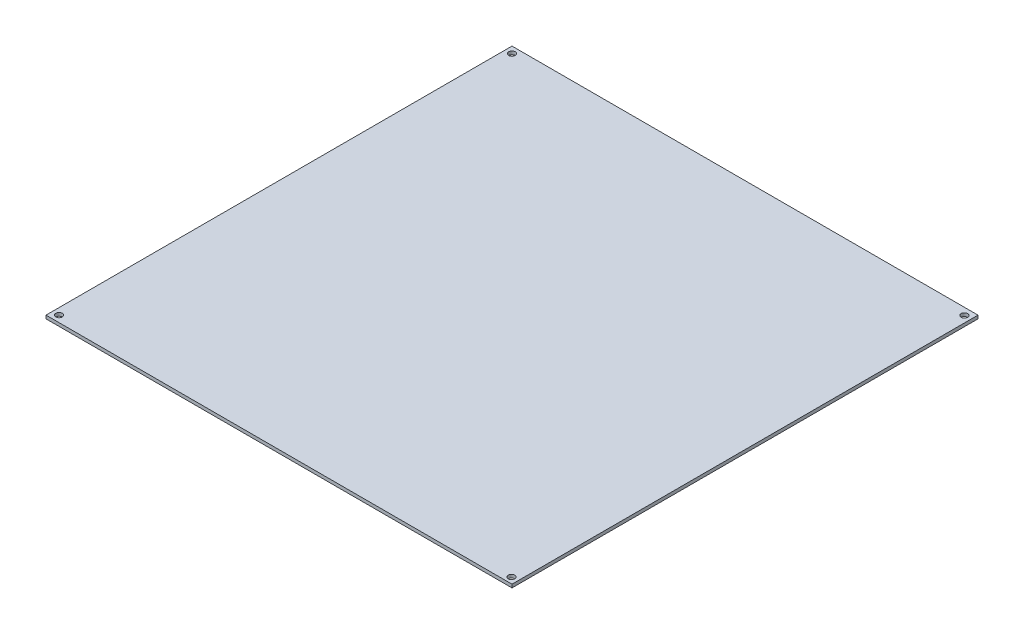
ISO-10303-21;
HEADER;
FILE_DESCRIPTION(('STEP AP214'),'2;1');
FILE_NAME('part.step','',(''),(''),'','','');
FILE_SCHEMA(('AUTOMOTIVE_DESIGN { 1 0 10303 214 1 1 1 1 }'));
ENDSEC;
DATA;
#1=APPLICATION_CONTEXT('core data for automotive mechanical design processes');
#2=APPLICATION_PROTOCOL_DEFINITION('international standard','automotive_design',2000,#1);
#3=PRODUCT_CONTEXT('',#1,'mechanical');
#4=PRODUCT('Part','Part','',(#3));
#5=PRODUCT_RELATED_PRODUCT_CATEGORY('part','',(#4));
#6=PRODUCT_DEFINITION_FORMATION('','',#4);
#7=PRODUCT_DEFINITION_CONTEXT('part definition',#1,'design');
#8=PRODUCT_DEFINITION('design','',#6,#7);
#9=PRODUCT_DEFINITION_SHAPE('','',#8);
#10=(LENGTH_UNIT() NAMED_UNIT(*) SI_UNIT(.MILLI.,.METRE.));
#11=(NAMED_UNIT(*) PLANE_ANGLE_UNIT() SI_UNIT($,.RADIAN.));
#12=(NAMED_UNIT(*) SI_UNIT($,.STERADIAN.) SOLID_ANGLE_UNIT());
#13=UNCERTAINTY_MEASURE_WITH_UNIT(LENGTH_MEASURE(1.E-05),#10,'distance_accuracy_value','');
#14=(GEOMETRIC_REPRESENTATION_CONTEXT(3) GLOBAL_UNCERTAINTY_ASSIGNED_CONTEXT((#13)) GLOBAL_UNIT_ASSIGNED_CONTEXT((#10,
#11,#12)) REPRESENTATION_CONTEXT('',''));
#15=CARTESIAN_POINT('',(0.,0.,0.));
#16=DIRECTION('',(0.,0.,1.));
#17=DIRECTION('',(1.,0.,0.));
#18=AXIS2_PLACEMENT_3D('',#15,#16,#17);
#19=CARTESIAN_POINT('',(0.,1.5,0.));
#20=DIRECTION('',(0.,1.,0.));
#21=DIRECTION('',(0.,0.,1.));
#22=AXIS2_PLACEMENT_3D('',#19,#20,#21);
#23=PLANE('',#22);
#24=CARTESIAN_POINT('',(-122.042987014463,1.5,149.317647058824));
#25=DIRECTION('',(0.,1.,0.));
#26=DIRECTION('',(0.,0.,1.));
#27=AXIS2_PLACEMENT_3D('',#24,#25,#26);
#28=CIRCLE('',#27,1.5);
#29=CARTESIAN_POINT('',(-122.042987014463,1.5,150.817647058824));
#30=VERTEX_POINT('',#29);
#31=EDGE_CURVE('E126',#30,#30,#28,.T.);
#32=ORIENTED_EDGE('',*,*,#31,.F.);
#33=EDGE_LOOP('',(#32));
#34=FACE_BOUND('',#33,.T.);
#35=CARTESIAN_POINT('',(-122.042987014463,1.5,-58.6823529411764));
#36=DIRECTION('',(0.,1.,0.));
#37=DIRECTION('',(0.,0.,1.));
#38=AXIS2_PLACEMENT_3D('',#35,#36,#37);
#39=CIRCLE('',#38,1.5);
#40=CARTESIAN_POINT('',(-122.042987014463,1.5,-57.1823529411764));
#41=VERTEX_POINT('',#40);
#42=EDGE_CURVE('E105',#41,#41,#39,.T.);
#43=ORIENTED_EDGE('',*,*,#42,.F.);
#44=EDGE_LOOP('',(#43));
#45=FACE_BOUND('',#44,.T.);
#46=DIRECTION('',(0.,0.,1.));
#47=VECTOR('',#46,1.);
#48=CARTESIAN_POINT('',(-125.043137254902,1.5,-61.6823529411765));
#49=LINE('',#48,#47);
#50=CARTESIAN_POINT('',(-125.043137254902,1.5,-61.6823529411765));
#51=VERTEX_POINT('',#50);
#52=CARTESIAN_POINT('',(-125.043137254902,1.5,152.317647058824));
#53=VERTEX_POINT('',#52);
#54=EDGE_CURVE('E90',#51,#53,#49,.T.);
#55=ORIENTED_EDGE('',*,*,#54,.T.);
#56=DIRECTION('',(1.,0.,0.));
#57=VECTOR('',#56,1.);
#58=CARTESIAN_POINT('',(-125.043137254902,1.5,152.317647058824));
#59=LINE('',#58,#57);
#60=CARTESIAN_POINT('',(88.9568627450981,1.5,152.317647058824));
#61=VERTEX_POINT('',#60);
#62=EDGE_CURVE('E85',#53,#61,#59,.T.);
#63=ORIENTED_EDGE('',*,*,#62,.T.);
#64=DIRECTION('',(0.,0.,-1.));
#65=VECTOR('',#64,1.);
#66=CARTESIAN_POINT('',(88.9568627450981,1.5,-61.6823529411765));
#67=LINE('',#66,#65);
#68=CARTESIAN_POINT('',(88.9568627450981,1.5,-61.6823529411765));
#69=VERTEX_POINT('',#68);
#70=EDGE_CURVE('E88',#61,#69,#67,.T.);
#71=ORIENTED_EDGE('',*,*,#70,.T.);
#72=DIRECTION('',(-1.,0.,0.));
#73=VECTOR('',#72,1.);
#74=CARTESIAN_POINT('',(-125.043137254902,1.5,-61.6823529411765));
#75=LINE('',#74,#73);
#76=EDGE_CURVE('E55',#69,#51,#75,.T.);
#77=ORIENTED_EDGE('',*,*,#76,.T.);
#78=EDGE_LOOP('',(#55,#63,#71,#77));
#79=FACE_BOUND('',#78,.T.);
#80=CARTESIAN_POINT('',(85.9568627450981,1.5,-58.4323529411764));
#81=DIRECTION('',(0.,1.,0.));
#82=DIRECTION('',(0.,0.,1.));
#83=AXIS2_PLACEMENT_3D('',#80,#81,#82);
#84=CIRCLE('',#83,1.5);
#85=CARTESIAN_POINT('',(85.9568627450981,1.5,-56.9323529411764));
#86=VERTEX_POINT('',#85);
#87=EDGE_CURVE('E120',#86,#86,#84,.T.);
#88=ORIENTED_EDGE('',*,*,#87,.F.);
#89=EDGE_LOOP('',(#88));
#90=FACE_BOUND('',#89,.T.);
#91=CARTESIAN_POINT('',(85.9568627450981,1.5,149.567647058824));
#92=DIRECTION('',(0.,1.,0.));
#93=DIRECTION('',(0.,0.,1.));
#94=AXIS2_PLACEMENT_3D('',#91,#92,#93);
#95=CIRCLE('',#94,1.5);
#96=CARTESIAN_POINT('',(85.9568627450981,1.5,151.067647058824));
#97=VERTEX_POINT('',#96);
#98=EDGE_CURVE('E132',#97,#97,#95,.T.);
#99=ORIENTED_EDGE('',*,*,#98,.F.);
#100=EDGE_LOOP('',(#99));
#101=FACE_BOUND('',#100,.T.);
#102=ADVANCED_FACE('F38',(#34,#45,#79,#90,#101),#23,.T.);
#103=CARTESIAN_POINT('',(0.,0.,0.));
#104=DIRECTION('',(0.,1.,0.));
#105=DIRECTION('',(0.,0.,1.));
#106=AXIS2_PLACEMENT_3D('',#103,#104,#105);
#107=PLANE('',#106);
#108=DIRECTION('',(0.,0.,1.));
#109=VECTOR('',#108,1.);
#110=CARTESIAN_POINT('',(-125.043137254902,0.,-61.6823529411765));
#111=LINE('',#110,#109);
#112=CARTESIAN_POINT('',(-125.043137254902,0.,-61.6823529411765));
#113=VERTEX_POINT('',#112);
#114=CARTESIAN_POINT('',(-125.043137254902,0.,152.317647058824));
#115=VERTEX_POINT('',#114);
#116=EDGE_CURVE('E102',#113,#115,#111,.T.);
#117=ORIENTED_EDGE('',*,*,#116,.F.);
#118=DIRECTION('',(-1.,0.,0.));
#119=VECTOR('',#118,1.);
#120=CARTESIAN_POINT('',(-125.043137254902,0.,-61.6823529411765));
#121=LINE('',#120,#119);
#122=CARTESIAN_POINT('',(88.9568627450981,0.,-61.6823529411765));
#123=VERTEX_POINT('',#122);
#124=EDGE_CURVE('E78',#123,#113,#121,.T.);
#125=ORIENTED_EDGE('',*,*,#124,.F.);
#126=DIRECTION('',(0.,0.,-1.));
#127=VECTOR('',#126,1.);
#128=CARTESIAN_POINT('',(88.9568627450981,0.,-61.6823529411765));
#129=LINE('',#128,#127);
#130=CARTESIAN_POINT('',(88.9568627450981,0.,152.317647058824));
#131=VERTEX_POINT('',#130);
#132=EDGE_CURVE('E72',#131,#123,#129,.T.);
#133=ORIENTED_EDGE('',*,*,#132,.F.);
#134=DIRECTION('',(1.,0.,0.));
#135=VECTOR('',#134,1.);
#136=CARTESIAN_POINT('',(-125.043137254902,0.,152.317647058824));
#137=LINE('',#136,#135);
#138=EDGE_CURVE('E94',#115,#131,#137,.T.);
#139=ORIENTED_EDGE('',*,*,#138,.F.);
#140=EDGE_LOOP('',(#117,#125,#133,#139));
#141=FACE_BOUND('',#140,.T.);
#142=CARTESIAN_POINT('',(-122.042987014463,0.,-58.6823529411764));
#143=DIRECTION('',(0.,1.,0.));
#144=DIRECTION('',(0.,0.,1.));
#145=AXIS2_PLACEMENT_3D('',#142,#143,#144);
#146=CIRCLE('',#145,1.5);
#147=CARTESIAN_POINT('',(-122.042987014463,0.,-57.1823529411764));
#148=VERTEX_POINT('',#147);
#149=EDGE_CURVE('E117',#148,#148,#146,.T.);
#150=ORIENTED_EDGE('',*,*,#149,.T.);
#151=EDGE_LOOP('',(#150));
#152=FACE_BOUND('',#151,.T.);
#153=CARTESIAN_POINT('',(85.9568627450981,0.,-58.4323529411764));
#154=DIRECTION('',(0.,1.,0.));
#155=DIRECTION('',(0.,0.,1.));
#156=AXIS2_PLACEMENT_3D('',#153,#154,#155);
#157=CIRCLE('',#156,1.5);
#158=CARTESIAN_POINT('',(85.9568627450981,0.,-56.9323529411764));
#159=VERTEX_POINT('',#158);
#160=EDGE_CURVE('E123',#159,#159,#157,.T.);
#161=ORIENTED_EDGE('',*,*,#160,.T.);
#162=EDGE_LOOP('',(#161));
#163=FACE_BOUND('',#162,.T.);
#164=CARTESIAN_POINT('',(-122.042987014463,0.,149.317647058824));
#165=DIRECTION('',(0.,1.,0.));
#166=DIRECTION('',(0.,0.,1.));
#167=AXIS2_PLACEMENT_3D('',#164,#165,#166);
#168=CIRCLE('',#167,1.5);
#169=CARTESIAN_POINT('',(-122.042987014463,0.,150.817647058824));
#170=VERTEX_POINT('',#169);
#171=EDGE_CURVE('E129',#170,#170,#168,.T.);
#172=ORIENTED_EDGE('',*,*,#171,.T.);
#173=EDGE_LOOP('',(#172));
#174=FACE_BOUND('',#173,.T.);
#175=CARTESIAN_POINT('',(85.9568627450981,0.,149.567647058824));
#176=DIRECTION('',(0.,1.,0.));
#177=DIRECTION('',(0.,0.,1.));
#178=AXIS2_PLACEMENT_3D('',#175,#176,#177);
#179=CIRCLE('',#178,1.5);
#180=CARTESIAN_POINT('',(85.9568627450981,0.,151.067647058824));
#181=VERTEX_POINT('',#180);
#182=EDGE_CURVE('E135',#181,#181,#179,.T.);
#183=ORIENTED_EDGE('',*,*,#182,.T.);
#184=EDGE_LOOP('',(#183));
#185=FACE_BOUND('',#184,.T.);
#186=ADVANCED_FACE('F113',(#141,#152,#163,#174,#185),#107,.F.);
#187=CARTESIAN_POINT('',(-125.043137254902,1.5,-61.6823529411765));
#188=DIRECTION('',(1.,0.,0.));
#189=DIRECTION('',(0.,0.,-1.));
#190=AXIS2_PLACEMENT_3D('',#187,#188,#189);
#191=PLANE('',#190);
#192=ORIENTED_EDGE('',*,*,#116,.T.);
#193=DIRECTION('',(0.,-1.,0.));
#194=VECTOR('',#193,1.);
#195=CARTESIAN_POINT('',(-125.043137254902,1.5,152.317647058824));
#196=LINE('',#195,#194);
#197=EDGE_CURVE('E11',#53,#115,#196,.T.);
#198=ORIENTED_EDGE('',*,*,#197,.F.);
#199=ORIENTED_EDGE('',*,*,#54,.F.);
#200=DIRECTION('',(0.,-1.,0.));
#201=VECTOR('',#200,1.);
#202=CARTESIAN_POINT('',(-125.043137254902,1.5,-61.6823529411765));
#203=LINE('',#202,#201);
#204=EDGE_CURVE('E98',#51,#113,#203,.T.);
#205=ORIENTED_EDGE('',*,*,#204,.T.);
#206=EDGE_LOOP('',(#192,#198,#199,#205));
#207=FACE_BOUND('',#206,.T.);
#208=ADVANCED_FACE('F40',(#207),#191,.F.);
#209=CARTESIAN_POINT('',(-125.043137254902,1.5,152.317647058824));
#210=DIRECTION('',(0.,0.,-1.));
#211=DIRECTION('',(-1.,0.,0.));
#212=AXIS2_PLACEMENT_3D('',#209,#210,#211);
#213=PLANE('',#212);
#214=ORIENTED_EDGE('',*,*,#138,.T.);
#215=DIRECTION('',(0.,-1.,0.));
#216=VECTOR('',#215,1.);
#217=CARTESIAN_POINT('',(88.9568627450981,1.5,152.317647058824));
#218=LINE('',#217,#216);
#219=EDGE_CURVE('E47',#61,#131,#218,.T.);
#220=ORIENTED_EDGE('',*,*,#219,.F.);
#221=ORIENTED_EDGE('',*,*,#62,.F.);
#222=ORIENTED_EDGE('',*,*,#197,.T.);
#223=EDGE_LOOP('',(#214,#220,#221,#222));
#224=FACE_BOUND('',#223,.T.);
#225=ADVANCED_FACE('F93',(#224),#213,.F.);
#226=CARTESIAN_POINT('',(88.9568627450981,1.5,-61.6823529411765));
#227=DIRECTION('',(-1.,0.,0.));
#228=DIRECTION('',(0.,0.,1.));
#229=AXIS2_PLACEMENT_3D('',#226,#227,#228);
#230=PLANE('',#229);
#231=ORIENTED_EDGE('',*,*,#132,.T.);
#232=DIRECTION('',(0.,-1.,0.));
#233=VECTOR('',#232,1.);
#234=CARTESIAN_POINT('',(88.9568627450981,1.5,-61.6823529411765));
#235=LINE('',#234,#233);
#236=EDGE_CURVE('E95',#69,#123,#235,.T.);
#237=ORIENTED_EDGE('',*,*,#236,.F.);
#238=ORIENTED_EDGE('',*,*,#70,.F.);
#239=ORIENTED_EDGE('',*,*,#219,.T.);
#240=EDGE_LOOP('',(#231,#237,#238,#239));
#241=FACE_BOUND('',#240,.T.);
#242=ADVANCED_FACE('F96',(#241),#230,.F.);
#243=CARTESIAN_POINT('',(-125.043137254902,1.5,-61.6823529411765));
#244=DIRECTION('',(0.,0.,1.));
#245=DIRECTION('',(1.,0.,0.));
#246=AXIS2_PLACEMENT_3D('',#243,#244,#245);
#247=PLANE('',#246);
#248=ORIENTED_EDGE('',*,*,#124,.T.);
#249=ORIENTED_EDGE('',*,*,#204,.F.);
#250=ORIENTED_EDGE('',*,*,#76,.F.);
#251=ORIENTED_EDGE('',*,*,#236,.T.);
#252=EDGE_LOOP('',(#248,#249,#250,#251));
#253=FACE_BOUND('',#252,.T.);
#254=ADVANCED_FACE('F110',(#253),#247,.F.);
#255=CARTESIAN_POINT('',(-122.042987014463,1.5,-58.6823529411764));
#256=DIRECTION('',(0.,-1.,0.));
#257=DIRECTION('',(0.,0.,-1.));
#258=AXIS2_PLACEMENT_3D('',#255,#256,#257);
#259=CYLINDRICAL_SURFACE('',#258,1.5);
#260=ORIENTED_EDGE('',*,*,#42,.T.);
#261=EDGE_LOOP('',(#260));
#262=FACE_BOUND('',#261,.T.);
#263=ORIENTED_EDGE('',*,*,#149,.F.);
#264=EDGE_LOOP('',(#263));
#265=FACE_BOUND('',#264,.T.);
#266=ADVANCED_FACE('F154',(#262,#265),#259,.F.);
#267=CARTESIAN_POINT('',(85.9568627450981,1.5,-58.4323529411764));
#268=DIRECTION('',(0.,-1.,0.));
#269=DIRECTION('',(0.,0.,-1.));
#270=AXIS2_PLACEMENT_3D('',#267,#268,#269);
#271=CYLINDRICAL_SURFACE('',#270,1.5);
#272=ORIENTED_EDGE('',*,*,#87,.T.);
#273=EDGE_LOOP('',(#272));
#274=FACE_BOUND('',#273,.T.);
#275=ORIENTED_EDGE('',*,*,#160,.F.);
#276=EDGE_LOOP('',(#275));
#277=FACE_BOUND('',#276,.T.);
#278=ADVANCED_FACE('F216',(#274,#277),#271,.F.);
#279=CARTESIAN_POINT('',(-122.042987014463,1.5,149.317647058824));
#280=DIRECTION('',(0.,-1.,0.));
#281=DIRECTION('',(0.,0.,-1.));
#282=AXIS2_PLACEMENT_3D('',#279,#280,#281);
#283=CYLINDRICAL_SURFACE('',#282,1.5);
#284=ORIENTED_EDGE('',*,*,#31,.T.);
#285=EDGE_LOOP('',(#284));
#286=FACE_BOUND('',#285,.T.);
#287=ORIENTED_EDGE('',*,*,#171,.F.);
#288=EDGE_LOOP('',(#287));
#289=FACE_BOUND('',#288,.T.);
#290=ADVANCED_FACE('F224',(#286,#289),#283,.F.);
#291=CARTESIAN_POINT('',(85.9568627450981,1.5,149.567647058824));
#292=DIRECTION('',(0.,-1.,0.));
#293=DIRECTION('',(0.,0.,-1.));
#294=AXIS2_PLACEMENT_3D('',#291,#292,#293);
#295=CYLINDRICAL_SURFACE('',#294,1.5);
#296=ORIENTED_EDGE('',*,*,#98,.T.);
#297=EDGE_LOOP('',(#296));
#298=FACE_BOUND('',#297,.T.);
#299=ORIENTED_EDGE('',*,*,#182,.F.);
#300=EDGE_LOOP('',(#299));
#301=FACE_BOUND('',#300,.T.);
#302=ADVANCED_FACE('F141',(#298,#301),#295,.F.);
#303=CLOSED_SHELL('',(#102,#186,#208,#225,#242,#254,#266,#278,#290,#302));
#304=MANIFOLD_SOLID_BREP('B2',#303);
#305=ADVANCED_BREP_SHAPE_REPRESENTATION('',(#18,#304),#14);
#306=SHAPE_DEFINITION_REPRESENTATION(#9,#305);
ENDSEC;
END-ISO-10303-21;
